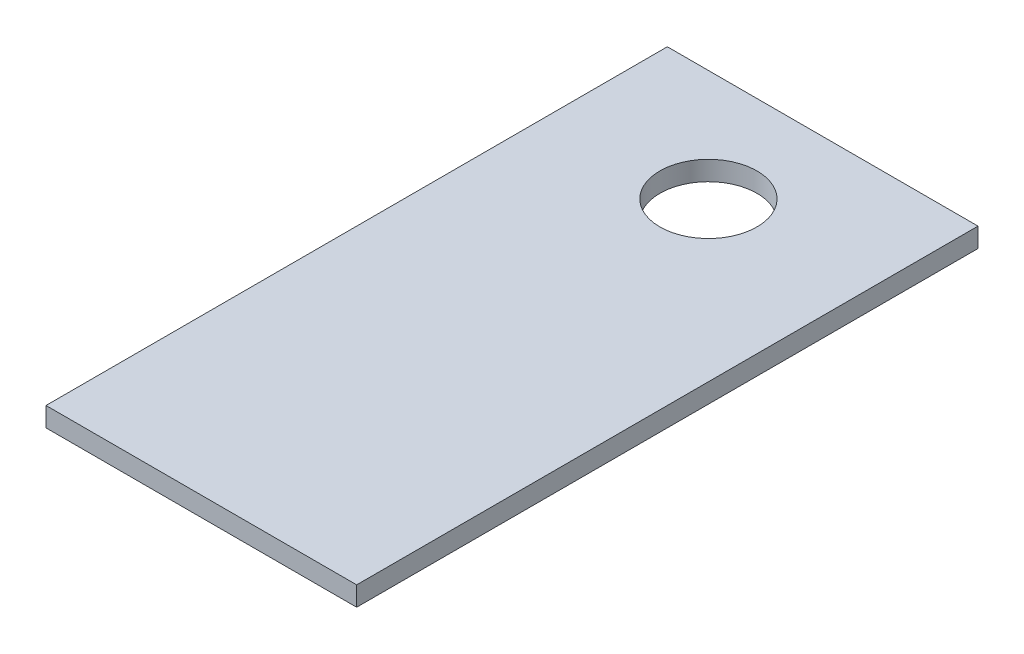
ISO-10303-21;
HEADER;
FILE_DESCRIPTION(('STEP AP214'),'2;1');
FILE_NAME('part.step','',(''),(''),'','','');
FILE_SCHEMA(('AUTOMOTIVE_DESIGN { 1 0 10303 214 1 1 1 1 }'));
ENDSEC;
DATA;
#1=APPLICATION_CONTEXT('core data for automotive mechanical design processes');
#2=APPLICATION_PROTOCOL_DEFINITION('international standard','automotive_design',2000,#1);
#3=PRODUCT_CONTEXT('',#1,'mechanical');
#4=PRODUCT('Part','Part','',(#3));
#5=PRODUCT_RELATED_PRODUCT_CATEGORY('part','',(#4));
#6=PRODUCT_DEFINITION_FORMATION('','',#4);
#7=PRODUCT_DEFINITION_CONTEXT('part definition',#1,'design');
#8=PRODUCT_DEFINITION('design','',#6,#7);
#9=PRODUCT_DEFINITION_SHAPE('','',#8);
#10=(LENGTH_UNIT() NAMED_UNIT(*) SI_UNIT(.MILLI.,.METRE.));
#11=(NAMED_UNIT(*) PLANE_ANGLE_UNIT() SI_UNIT($,.RADIAN.));
#12=(NAMED_UNIT(*) SI_UNIT($,.STERADIAN.) SOLID_ANGLE_UNIT());
#13=UNCERTAINTY_MEASURE_WITH_UNIT(LENGTH_MEASURE(1.E-05),#10,'distance_accuracy_value','');
#14=(GEOMETRIC_REPRESENTATION_CONTEXT(3) GLOBAL_UNCERTAINTY_ASSIGNED_CONTEXT((#13)) GLOBAL_UNIT_ASSIGNED_CONTEXT((#10,
#11,#12)) REPRESENTATION_CONTEXT('',''));
#15=CARTESIAN_POINT('',(0.,0.,0.));
#16=DIRECTION('',(0.,0.,1.));
#17=DIRECTION('',(1.,0.,0.));
#18=AXIS2_PLACEMENT_3D('',#15,#16,#17);
#19=CARTESIAN_POINT('',(0.,1.5875,0.));
#20=DIRECTION('',(0.,-1.,0.));
#21=DIRECTION('',(0.,0.,-1.));
#22=AXIS2_PLACEMENT_3D('',#19,#20,#21);
#23=PLANE('',#22);
#24=DIRECTION('',(0.,0.,1.));
#25=VECTOR('',#24,1.);
#26=CARTESIAN_POINT('',(0.,1.5875,0.));
#27=LINE('',#26,#25);
#28=CARTESIAN_POINT('',(0.,1.5875,-50.8));
#29=VERTEX_POINT('',#28);
#30=CARTESIAN_POINT('',(0.,1.5875,0.));
#31=VERTEX_POINT('',#30);
#32=EDGE_CURVE('E89',#29,#31,#27,.T.);
#33=ORIENTED_EDGE('',*,*,#32,.T.);
#34=DIRECTION('',(1.,0.,0.));
#35=VECTOR('',#34,1.);
#36=CARTESIAN_POINT('',(0.,1.5875,0.));
#37=LINE('',#36,#35);
#38=CARTESIAN_POINT('',(25.4,1.5875,0.));
#39=VERTEX_POINT('',#38);
#40=EDGE_CURVE('E84',#31,#39,#37,.T.);
#41=ORIENTED_EDGE('',*,*,#40,.T.);
#42=DIRECTION('',(0.,0.,-1.));
#43=VECTOR('',#42,1.);
#44=CARTESIAN_POINT('',(25.4,1.5875,0.));
#45=LINE('',#44,#43);
#46=CARTESIAN_POINT('',(25.4,1.5875,-50.8));
#47=VERTEX_POINT('',#46);
#48=EDGE_CURVE('E87',#39,#47,#45,.T.);
#49=ORIENTED_EDGE('',*,*,#48,.T.);
#50=DIRECTION('',(-1.,0.,0.));
#51=VECTOR('',#50,1.);
#52=CARTESIAN_POINT('',(0.,1.5875,-50.8));
#53=LINE('',#52,#51);
#54=EDGE_CURVE('E54',#47,#29,#53,.T.);
#55=ORIENTED_EDGE('',*,*,#54,.T.);
#56=EDGE_LOOP('',(#33,#41,#49,#55));
#57=FACE_BOUND('',#56,.T.);
#58=CARTESIAN_POINT('',(12.4541935483871,1.5875,-41.7051612903226));
#59=DIRECTION('',(0.,1.,0.));
#60=DIRECTION('',(0.,0.,1.));
#61=AXIS2_PLACEMENT_3D('',#58,#59,#60);
#62=CIRCLE('',#61,3.96875);
#63=CARTESIAN_POINT('',(12.4541935483871,1.5875,-37.7364112903226));
#64=VERTEX_POINT('',#63);
#65=EDGE_CURVE('E104',#64,#64,#62,.T.);
#66=ORIENTED_EDGE('',*,*,#65,.F.);
#67=EDGE_LOOP('',(#66));
#68=FACE_BOUND('',#67,.T.);
#69=ADVANCED_FACE('F37',(#57,#68),#23,.F.);
#70=CARTESIAN_POINT('',(0.,0.,0.));
#71=DIRECTION('',(0.,-1.,0.));
#72=DIRECTION('',(0.,0.,-1.));
#73=AXIS2_PLACEMENT_3D('',#70,#71,#72);
#74=PLANE('',#73);
#75=DIRECTION('',(0.,0.,1.));
#76=VECTOR('',#75,1.);
#77=CARTESIAN_POINT('',(0.,0.,0.));
#78=LINE('',#77,#76);
#79=CARTESIAN_POINT('',(0.,0.,-50.8));
#80=VERTEX_POINT('',#79);
#81=CARTESIAN_POINT('',(0.,0.,0.));
#82=VERTEX_POINT('',#81);
#83=EDGE_CURVE('E101',#80,#82,#78,.T.);
#84=ORIENTED_EDGE('',*,*,#83,.F.);
#85=DIRECTION('',(-1.,0.,0.));
#86=VECTOR('',#85,1.);
#87=CARTESIAN_POINT('',(0.,0.,-50.8));
#88=LINE('',#87,#86);
#89=CARTESIAN_POINT('',(25.4,0.,-50.8));
#90=VERTEX_POINT('',#89);
#91=EDGE_CURVE('E77',#90,#80,#88,.T.);
#92=ORIENTED_EDGE('',*,*,#91,.F.);
#93=DIRECTION('',(0.,0.,-1.));
#94=VECTOR('',#93,1.);
#95=CARTESIAN_POINT('',(25.4,0.,0.));
#96=LINE('',#95,#94);
#97=CARTESIAN_POINT('',(25.4,0.,0.));
#98=VERTEX_POINT('',#97);
#99=EDGE_CURVE('E71',#98,#90,#96,.T.);
#100=ORIENTED_EDGE('',*,*,#99,.F.);
#101=DIRECTION('',(1.,0.,0.));
#102=VECTOR('',#101,1.);
#103=CARTESIAN_POINT('',(0.,0.,0.));
#104=LINE('',#103,#102);
#105=EDGE_CURVE('E93',#82,#98,#104,.T.);
#106=ORIENTED_EDGE('',*,*,#105,.F.);
#107=EDGE_LOOP('',(#84,#92,#100,#106));
#108=FACE_BOUND('',#107,.T.);
#109=CARTESIAN_POINT('',(12.4541935483871,0.,-41.7051612903226));
#110=DIRECTION('',(0.,1.,0.));
#111=DIRECTION('',(0.,0.,1.));
#112=AXIS2_PLACEMENT_3D('',#109,#110,#111);
#113=CIRCLE('',#112,3.96875);
#114=CARTESIAN_POINT('',(12.4541935483871,0.,-37.7364112903226));
#115=VERTEX_POINT('',#114);
#116=EDGE_CURVE('E116',#115,#115,#113,.T.);
#117=ORIENTED_EDGE('',*,*,#116,.T.);
#118=EDGE_LOOP('',(#117));
#119=FACE_BOUND('',#118,.T.);
#120=ADVANCED_FACE('F112',(#108,#119),#74,.T.);
#121=CARTESIAN_POINT('',(0.,1.5875,0.));
#122=DIRECTION('',(1.,0.,0.));
#123=DIRECTION('',(0.,0.,-1.));
#124=AXIS2_PLACEMENT_3D('',#121,#122,#123);
#125=PLANE('',#124);
#126=ORIENTED_EDGE('',*,*,#83,.T.);
#127=DIRECTION('',(0.,-1.,0.));
#128=VECTOR('',#127,1.);
#129=CARTESIAN_POINT('',(0.,1.5875,0.));
#130=LINE('',#129,#128);
#131=EDGE_CURVE('E11',#31,#82,#130,.T.);
#132=ORIENTED_EDGE('',*,*,#131,.F.);
#133=ORIENTED_EDGE('',*,*,#32,.F.);
#134=DIRECTION('',(0.,-1.,0.));
#135=VECTOR('',#134,1.);
#136=CARTESIAN_POINT('',(0.,1.5875,-50.8));
#137=LINE('',#136,#135);
#138=EDGE_CURVE('E97',#29,#80,#137,.T.);
#139=ORIENTED_EDGE('',*,*,#138,.T.);
#140=EDGE_LOOP('',(#126,#132,#133,#139));
#141=FACE_BOUND('',#140,.T.);
#142=ADVANCED_FACE('F39',(#141),#125,.F.);
#143=CARTESIAN_POINT('',(0.,1.5875,0.));
#144=DIRECTION('',(0.,0.,-1.));
#145=DIRECTION('',(-1.,0.,0.));
#146=AXIS2_PLACEMENT_3D('',#143,#144,#145);
#147=PLANE('',#146);
#148=ORIENTED_EDGE('',*,*,#105,.T.);
#149=DIRECTION('',(0.,-1.,0.));
#150=VECTOR('',#149,1.);
#151=CARTESIAN_POINT('',(25.4,1.5875,0.));
#152=LINE('',#151,#150);
#153=EDGE_CURVE('E46',#39,#98,#152,.T.);
#154=ORIENTED_EDGE('',*,*,#153,.F.);
#155=ORIENTED_EDGE('',*,*,#40,.F.);
#156=ORIENTED_EDGE('',*,*,#131,.T.);
#157=EDGE_LOOP('',(#148,#154,#155,#156));
#158=FACE_BOUND('',#157,.T.);
#159=ADVANCED_FACE('F92',(#158),#147,.F.);
#160=CARTESIAN_POINT('',(25.4,1.5875,0.));
#161=DIRECTION('',(-1.,0.,0.));
#162=DIRECTION('',(0.,0.,1.));
#163=AXIS2_PLACEMENT_3D('',#160,#161,#162);
#164=PLANE('',#163);
#165=ORIENTED_EDGE('',*,*,#99,.T.);
#166=DIRECTION('',(0.,-1.,0.));
#167=VECTOR('',#166,1.);
#168=CARTESIAN_POINT('',(25.4,1.5875,-50.8));
#169=LINE('',#168,#167);
#170=EDGE_CURVE('E94',#47,#90,#169,.T.);
#171=ORIENTED_EDGE('',*,*,#170,.F.);
#172=ORIENTED_EDGE('',*,*,#48,.F.);
#173=ORIENTED_EDGE('',*,*,#153,.T.);
#174=EDGE_LOOP('',(#165,#171,#172,#173));
#175=FACE_BOUND('',#174,.T.);
#176=ADVANCED_FACE('F95',(#175),#164,.F.);
#177=CARTESIAN_POINT('',(0.,1.5875,-50.8));
#178=DIRECTION('',(0.,0.,1.));
#179=DIRECTION('',(1.,0.,0.));
#180=AXIS2_PLACEMENT_3D('',#177,#178,#179);
#181=PLANE('',#180);
#182=ORIENTED_EDGE('',*,*,#91,.T.);
#183=ORIENTED_EDGE('',*,*,#138,.F.);
#184=ORIENTED_EDGE('',*,*,#54,.F.);
#185=ORIENTED_EDGE('',*,*,#170,.T.);
#186=EDGE_LOOP('',(#182,#183,#184,#185));
#187=FACE_BOUND('',#186,.T.);
#188=ADVANCED_FACE('F109',(#187),#181,.F.);
#189=CARTESIAN_POINT('',(12.4541935483871,1.5875,-41.7051612903226));
#190=DIRECTION('',(0.,-1.,0.));
#191=DIRECTION('',(0.,0.,-1.));
#192=AXIS2_PLACEMENT_3D('',#189,#190,#191);
#193=CYLINDRICAL_SURFACE('',#192,3.96875);
#194=ORIENTED_EDGE('',*,*,#65,.T.);
#195=EDGE_LOOP('',(#194));
#196=FACE_BOUND('',#195,.T.);
#197=ORIENTED_EDGE('',*,*,#116,.F.);
#198=EDGE_LOOP('',(#197));
#199=FACE_BOUND('',#198,.T.);
#200=ADVANCED_FACE('F122',(#196,#199),#193,.F.);
#201=CLOSED_SHELL('',(#69,#120,#142,#159,#176,#188,#200));
#202=MANIFOLD_SOLID_BREP('B2',#201);
#203=ADVANCED_BREP_SHAPE_REPRESENTATION('',(#18,#202),#14);
#204=SHAPE_DEFINITION_REPRESENTATION(#9,#203);
ENDSEC;
END-ISO-10303-21;
